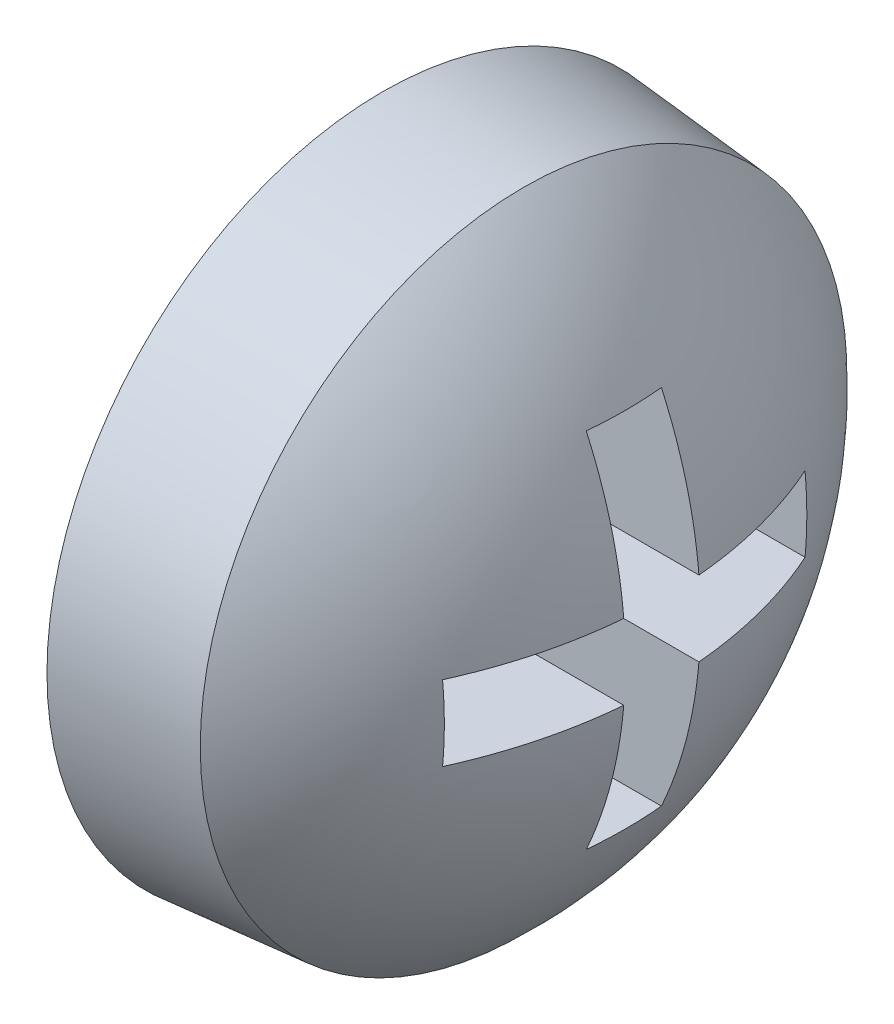
ISO-10303-21;
HEADER;
FILE_DESCRIPTION(('STEP AP214'),'2;1');
FILE_NAME('part.step','',(''),(''),'','','');
FILE_SCHEMA(('AUTOMOTIVE_DESIGN { 1 0 10303 214 1 1 1 1 }'));
ENDSEC;
DATA;
#1=APPLICATION_CONTEXT('core data for automotive mechanical design processes');
#2=APPLICATION_PROTOCOL_DEFINITION('international standard','automotive_design',2000,#1);
#3=PRODUCT_CONTEXT('',#1,'mechanical');
#4=PRODUCT('Part','Part','',(#3));
#5=PRODUCT_RELATED_PRODUCT_CATEGORY('part','',(#4));
#6=PRODUCT_DEFINITION_FORMATION('','',#4);
#7=PRODUCT_DEFINITION_CONTEXT('part definition',#1,'design');
#8=PRODUCT_DEFINITION('design','',#6,#7);
#9=PRODUCT_DEFINITION_SHAPE('','',#8);
#10=(LENGTH_UNIT() NAMED_UNIT(*) SI_UNIT(.MILLI.,.METRE.));
#11=(NAMED_UNIT(*) PLANE_ANGLE_UNIT() SI_UNIT($,.RADIAN.));
#12=(NAMED_UNIT(*) SI_UNIT($,.STERADIAN.) SOLID_ANGLE_UNIT());
#13=UNCERTAINTY_MEASURE_WITH_UNIT(LENGTH_MEASURE(1.E-05),#10,'distance_accuracy_value','');
#14=(GEOMETRIC_REPRESENTATION_CONTEXT(3) GLOBAL_UNCERTAINTY_ASSIGNED_CONTEXT((#13)) GLOBAL_UNIT_ASSIGNED_CONTEXT((#10,
#11,#12)) REPRESENTATION_CONTEXT('',''));
#15=CARTESIAN_POINT('',(0.,0.,0.));
#16=DIRECTION('',(0.,0.,1.));
#17=DIRECTION('',(1.,0.,0.));
#18=AXIS2_PLACEMENT_3D('',#15,#16,#17);
#19=CARTESIAN_POINT('',(0.549999999999995,0.,0.));
#20=DIRECTION('',(1.,0.,0.));
#21=DIRECTION('',(0.,0.,-1.));
#22=AXIS2_PLACEMENT_3D('',#19,#20,#21);
#23=PLANE('',#22);
#24=DIRECTION('',(0.,0.,1.));
#25=VECTOR('',#24,1.);
#26=CARTESIAN_POINT('',(0.549999999999995,-1.35,0.));
#27=LINE('',#26,#25);
#28=CARTESIAN_POINT('',(0.549999999999995,-1.35,-0.280000000000002));
#29=VERTEX_POINT('',#28);
#30=CARTESIAN_POINT('',(0.549999999999995,-1.35,0.280000000000001));
#31=VERTEX_POINT('',#30);
#32=EDGE_CURVE('E160',#29,#31,#27,.T.);
#33=ORIENTED_EDGE('',*,*,#32,.F.);
#34=DIRECTION('',(0.,1.,0.));
#35=VECTOR('',#34,1.);
#36=CARTESIAN_POINT('',(0.549999999999995,0.,-0.280000000000002));
#37=LINE('',#36,#35);
#38=CARTESIAN_POINT('',(0.549999999999995,-0.279999999999999,-0.280000000000002));
#39=VERTEX_POINT('',#38);
#40=EDGE_CURVE('E165',#39,#29,#37,.F.);
#41=ORIENTED_EDGE('',*,*,#40,.F.);
#42=DIRECTION('',(0.,0.,1.));
#43=VECTOR('',#42,1.);
#44=CARTESIAN_POINT('',(0.549999999999995,-0.279999999999999,0.));
#45=LINE('',#44,#43);
#46=CARTESIAN_POINT('',(0.549999999999995,-0.279999999999999,-1.35));
#47=VERTEX_POINT('',#46);
#48=EDGE_CURVE('E170',#47,#39,#45,.T.);
#49=ORIENTED_EDGE('',*,*,#48,.F.);
#50=DIRECTION('',(0.,1.,0.));
#51=VECTOR('',#50,1.);
#52=CARTESIAN_POINT('',(0.549999999999995,0.,-1.35));
#53=LINE('',#52,#51);
#54=CARTESIAN_POINT('',(0.549999999999995,0.280000000000002,-1.35));
#55=VERTEX_POINT('',#54);
#56=EDGE_CURVE('E175',#55,#47,#53,.F.);
#57=ORIENTED_EDGE('',*,*,#56,.F.);
#58=DIRECTION('',(0.,0.,-1.));
#59=VECTOR('',#58,1.);
#60=CARTESIAN_POINT('',(0.549999999999995,0.280000000000002,0.));
#61=LINE('',#60,#59);
#62=CARTESIAN_POINT('',(0.549999999999995,0.280000000000002,-0.280000000000002));
#63=VERTEX_POINT('',#62);
#64=EDGE_CURVE('E180',#63,#55,#61,.T.);
#65=ORIENTED_EDGE('',*,*,#64,.F.);
#66=DIRECTION('',(0.,1.,0.));
#67=VECTOR('',#66,1.);
#68=CARTESIAN_POINT('',(0.549999999999995,0.,-0.280000000000002));
#69=LINE('',#68,#67);
#70=CARTESIAN_POINT('',(0.549999999999995,1.35,-0.280000000000002));
#71=VERTEX_POINT('',#70);
#72=EDGE_CURVE('E185',#71,#63,#69,.F.);
#73=ORIENTED_EDGE('',*,*,#72,.F.);
#74=DIRECTION('',(0.,0.,1.));
#75=VECTOR('',#74,1.);
#76=CARTESIAN_POINT('',(0.549999999999995,1.35,0.));
#77=LINE('',#76,#75);
#78=CARTESIAN_POINT('',(0.549999999999995,1.35,0.280000000000001));
#79=VERTEX_POINT('',#78);
#80=EDGE_CURVE('E131',#71,#79,#77,.T.);
#81=ORIENTED_EDGE('',*,*,#80,.T.);
#82=DIRECTION('',(0.,1.,0.));
#83=VECTOR('',#82,1.);
#84=CARTESIAN_POINT('',(0.549999999999995,0.,0.279999999999999));
#85=LINE('',#84,#83);
#86=CARTESIAN_POINT('',(0.549999999999995,0.280000000000002,0.280000000000001));
#87=VERTEX_POINT('',#86);
#88=EDGE_CURVE('E128',#87,#79,#85,.T.);
#89=ORIENTED_EDGE('',*,*,#88,.F.);
#90=DIRECTION('',(0.,0.,-1.));
#91=VECTOR('',#90,1.);
#92=CARTESIAN_POINT('',(0.549999999999995,0.280000000000002,0.));
#93=LINE('',#92,#91);
#94=CARTESIAN_POINT('',(0.549999999999995,0.280000000000002,1.35));
#95=VERTEX_POINT('',#94);
#96=EDGE_CURVE('E122',#95,#87,#93,.T.);
#97=ORIENTED_EDGE('',*,*,#96,.F.);
#98=DIRECTION('',(0.,1.,0.));
#99=VECTOR('',#98,1.);
#100=CARTESIAN_POINT('',(0.549999999999995,0.,1.35));
#101=LINE('',#100,#99);
#102=CARTESIAN_POINT('',(0.549999999999995,-0.279999999999999,1.35));
#103=VERTEX_POINT('',#102);
#104=EDGE_CURVE('E92',#95,#103,#101,.F.);
#105=ORIENTED_EDGE('',*,*,#104,.T.);
#106=DIRECTION('',(0.,0.,1.));
#107=VECTOR('',#106,1.);
#108=CARTESIAN_POINT('',(0.549999999999995,-0.279999999999999,0.));
#109=LINE('',#108,#107);
#110=CARTESIAN_POINT('',(0.549999999999995,-0.279999999999999,0.280000000000001));
#111=VERTEX_POINT('',#110);
#112=EDGE_CURVE('E145',#111,#103,#109,.T.);
#113=ORIENTED_EDGE('',*,*,#112,.F.);
#114=DIRECTION('',(0.,1.,0.));
#115=VECTOR('',#114,1.);
#116=CARTESIAN_POINT('',(0.549999999999995,0.,0.279999999999999));
#117=LINE('',#116,#115);
#118=EDGE_CURVE('E155',#31,#111,#117,.T.);
#119=ORIENTED_EDGE('',*,*,#118,.F.);
#120=EDGE_LOOP('',(#33,#41,#49,#57,#65,#73,#81,#89,#97,#105,#113,#119));
#121=FACE_BOUND('',#120,.T.);
#122=ADVANCED_FACE('F17',(#121),#23,.T.);
#123=CARTESIAN_POINT('',(1.32499999999999,0.280000000000002,0.));
#124=DIRECTION('',(0.,-1.,0.));
#125=DIRECTION('',(0.,0.,-1.));
#126=AXIS2_PLACEMENT_3D('',#123,#124,#125);
#127=PLANE('',#126);
#128=DIRECTION('',(1.,0.,0.));
#129=VECTOR('',#128,1.);
#130=CARTESIAN_POINT('',(1.32499999999999,0.280000000000002,1.35));
#131=LINE('',#130,#129);
#132=CARTESIAN_POINT('',(1.79681603311908,0.280000000000002,1.35));
#133=VERTEX_POINT('',#132);
#134=EDGE_CURVE('E125',#133,#95,#131,.F.);
#135=ORIENTED_EDGE('',*,*,#134,.T.);
#136=ORIENTED_EDGE('',*,*,#96,.T.);
#137=DIRECTION('',(-1.,0.,0.));
#138=VECTOR('',#137,1.);
#139=CARTESIAN_POINT('',(1.32499999999999,0.280000000000002,0.279999999999999));
#140=LINE('',#139,#138);
#141=CARTESIAN_POINT('',(2.07605753086498,0.279999999999999,0.279999999999997));
#142=VERTEX_POINT('',#141);
#143=EDGE_CURVE('E77',#142,#87,#140,.T.);
#144=ORIENTED_EDGE('',*,*,#143,.F.);
#145=CARTESIAN_POINT('',(1.79681603311908,0.280000000000002,1.35));
#146=CARTESIAN_POINT('',(1.81602408056137,0.280000000000002,1.307554580257));
#147=CARTESIAN_POINT('',(1.83432508142264,0.280000000000002,1.26469878554267));
#148=CARTESIAN_POINT('',(1.86898914421727,0.280000000000002,1.17847728027552));
#149=CARTESIAN_POINT('',(1.88536206864593,0.280000000000002,1.13511553461517));
#150=CARTESIAN_POINT('',(1.91619749437211,0.280000000000002,1.04789225253094));
#151=CARTESIAN_POINT('',(1.93066661088959,0.280000000000002,1.00403305466245));
#152=CARTESIAN_POINT('',(1.95771277194949,0.280000000000002,0.915821473663348));
#153=CARTESIAN_POINT('',(1.97029317484131,0.280000000000002,0.871470120193011));
#154=CARTESIAN_POINT('',(1.9935704971157,0.280000000000002,0.782275874227943));
#155=CARTESIAN_POINT('',(2.00426741649827,0.280000000000002,0.737432981733211));
#156=CARTESIAN_POINT('',(2.02377634055015,0.280000000000002,0.647254382649075));
#157=CARTESIAN_POINT('',(2.03258491199652,0.280000000000002,0.601917933300477));
#158=CARTESIAN_POINT('',(2.04830486371433,0.280000000000003,0.510749915140327));
#159=CARTESIAN_POINT('',(2.05520932962495,0.280000000000003,0.464917154023976));
#160=CARTESIAN_POINT('',(2.06709937153223,0.280000000000002,0.37275223595096));
#161=CARTESIAN_POINT('',(2.07207440527889,0.280000000000001,0.326418718791774));
#162=CARTESIAN_POINT('',(2.07605753086497,0.279999999999999,0.279999999999996));
#163=B_SPLINE_CURVE_WITH_KNOTS('',3,(#145,#146,#147,#148,#149,#150,#151,#152,#153,#154,#155,
#156,#157,#158,#159,#160,#161,#162),.UNSPECIFIED.,.F.,.F.,(4,2,2,2,2,2,2,2,4),(0.,
0.139757136239739,0.278765100161038,0.417276520373942,0.555538657686308,0.693800794998674,
0.832312215211578,0.971320179132877,1.11107731537262),.UNSPECIFIED.);
#164=EDGE_CURVE('E20',#133,#142,#163,.T.);
#165=ORIENTED_EDGE('',*,*,#164,.F.);
#166=EDGE_LOOP('',(#135,#136,#144,#165));
#167=FACE_BOUND('',#166,.T.);
#168=ADVANCED_FACE('F124',(#167),#127,.T.);
#169=CARTESIAN_POINT('',(1.32499999999999,0.,0.279999999999999));
#170=DIRECTION('',(0.,0.,-1.));
#171=DIRECTION('',(-1.,0.,0.));
#172=AXIS2_PLACEMENT_3D('',#169,#170,#171);
#173=PLANE('',#172);
#174=ORIENTED_EDGE('',*,*,#88,.T.);
#175=DIRECTION('',(1.,0.,0.));
#176=VECTOR('',#175,1.);
#177=CARTESIAN_POINT('',(1.32499999999999,1.35,0.279999999999999));
#178=LINE('',#177,#176);
#179=CARTESIAN_POINT('',(1.79681603311908,1.35,0.279999999999999));
#180=VERTEX_POINT('',#179);
#181=EDGE_CURVE('E191',#79,#180,#178,.T.);
#182=ORIENTED_EDGE('',*,*,#181,.T.);
#183=CARTESIAN_POINT('',(2.07605753086497,0.279999999999999,0.279999999999996));
#184=CARTESIAN_POINT('',(2.06661079201182,0.390354074953385,0.279999999999998));
#185=CARTESIAN_POINT('',(2.05151697522497,0.500241063028344,0.279999999999999));
#186=CARTESIAN_POINT('',(2.01046909367367,0.717000858189269,0.279999999999999));
#187=CARTESIAN_POINT('',(1.98460832939249,0.823891335937797,0.279999999999999));
#188=CARTESIAN_POINT('',(1.93225828077782,1.00080541366203,0.279999999999999));
#189=CARTESIAN_POINT('',(1.90861656844528,1.07168394428635,0.279999999999999));
#190=CARTESIAN_POINT('',(1.85639490068904,1.21206786247378,0.279999999999999));
#191=CARTESIAN_POINT('',(1.82778700479986,1.28156285719201,0.28));
#192=CARTESIAN_POINT('',(1.79681603311908,1.34999999999999,0.280000000000002));
#193=B_SPLINE_CURVE_WITH_KNOTS('',3,(#183,#184,#185,#186,#187,#188,#189,#190,#191,#192),
.UNSPECIFIED.,.F.,.F.,(4,2,2,2,4),(0.,0.332166147649365,0.661511935360257,0.88549960279256,
1.11079091170104),.UNSPECIFIED.);
#194=EDGE_CURVE('E137',#142,#180,#193,.T.);
#195=ORIENTED_EDGE('',*,*,#194,.F.);
#196=ORIENTED_EDGE('',*,*,#143,.T.);
#197=EDGE_LOOP('',(#174,#182,#195,#196));
#198=FACE_BOUND('',#197,.T.);
#199=ADVANCED_FACE('F135',(#198),#173,.T.);
#200=CARTESIAN_POINT('',(1.32499999999999,1.35,0.));
#201=DIRECTION('',(0.,1.,0.));
#202=DIRECTION('',(0.,0.,1.));
#203=AXIS2_PLACEMENT_3D('',#200,#201,#202);
#204=PLANE('',#203);
#205=ORIENTED_EDGE('',*,*,#181,.F.);
#206=ORIENTED_EDGE('',*,*,#80,.F.);
#207=DIRECTION('',(1.,0.,0.));
#208=VECTOR('',#207,1.);
#209=CARTESIAN_POINT('',(1.32499999999999,1.35,-0.280000000000002));
#210=LINE('',#209,#208);
#211=CARTESIAN_POINT('',(1.79681603311908,1.35,-0.280000000000002));
#212=VERTEX_POINT('',#211);
#213=EDGE_CURVE('E187',#212,#71,#210,.F.);
#214=ORIENTED_EDGE('',*,*,#213,.F.);
#215=CARTESIAN_POINT('',(1.79681603311908,1.35,0.279999999999999));
#216=CARTESIAN_POINT('',(1.80555669105246,1.35,0.186666666666665));
#217=CARTESIAN_POINT('',(1.80992702001915,1.35,0.0933333333333319));
#218=CARTESIAN_POINT('',(1.80992702001915,1.35,-0.0933333333333353));
#219=CARTESIAN_POINT('',(1.80555669105246,1.35,-0.186666666666669));
#220=CARTESIAN_POINT('',(1.79681603311908,1.35,-0.280000000000002));
#221=B_SPLINE_CURVE_WITH_KNOTS('',3,(#215,#216,#217,#218,#219,#220),.UNSPECIFIED.,.F.,.F.,(4,2,
4),(0.,0.280306792599634,0.560613585199268),.UNSPECIFIED.);
#222=EDGE_CURVE('E265',#180,#212,#221,.T.);
#223=ORIENTED_EDGE('',*,*,#222,.F.);
#224=EDGE_LOOP('',(#205,#206,#214,#223));
#225=FACE_BOUND('',#224,.T.);
#226=ADVANCED_FACE('F266',(#225),#204,.F.);
#227=CARTESIAN_POINT('',(1.32499999999999,0.,-0.280000000000002));
#228=DIRECTION('',(0.,0.,1.));
#229=DIRECTION('',(1.,0.,0.));
#230=AXIS2_PLACEMENT_3D('',#227,#228,#229);
#231=PLANE('',#230);
#232=ORIENTED_EDGE('',*,*,#72,.T.);
#233=DIRECTION('',(1.,0.,0.));
#234=VECTOR('',#233,1.);
#235=CARTESIAN_POINT('',(1.32499999999999,0.280000000000002,-0.280000000000002));
#236=LINE('',#235,#234);
#237=CARTESIAN_POINT('',(2.07605753086498,0.280000000000002,-0.280000000000002));
#238=VERTEX_POINT('',#237);
#239=EDGE_CURVE('E182',#238,#63,#236,.F.);
#240=ORIENTED_EDGE('',*,*,#239,.F.);
#241=CARTESIAN_POINT('',(1.79681603311908,1.35,-0.280000000000002));
#242=CARTESIAN_POINT('',(1.81602408056137,1.307554580257,-0.280000000000002));
#243=CARTESIAN_POINT('',(1.83432508142264,1.26469878554267,-0.280000000000002));
#244=CARTESIAN_POINT('',(1.86898914421727,1.17847728027552,-0.280000000000002));
#245=CARTESIAN_POINT('',(1.88536206864593,1.13511553461517,-0.280000000000002));
#246=CARTESIAN_POINT('',(1.91619749437211,1.04789225253095,-0.280000000000002));
#247=CARTESIAN_POINT('',(1.93066661088959,1.00403305466245,-0.280000000000002));
#248=CARTESIAN_POINT('',(1.95771277194949,0.915821473663351,-0.280000000000002));
#249=CARTESIAN_POINT('',(1.97029317484131,0.871470120193015,-0.280000000000002));
#250=CARTESIAN_POINT('',(1.9935704971157,0.782275874227946,-0.280000000000002));
#251=CARTESIAN_POINT('',(2.00426741649827,0.737432981733214,-0.280000000000002));
#252=CARTESIAN_POINT('',(2.02377634055015,0.647254382649079,-0.280000000000002));
#253=CARTESIAN_POINT('',(2.03258491199652,0.60191793330048,-0.280000000000002));
#254=CARTESIAN_POINT('',(2.04830486371433,0.51074991514033,-0.280000000000003));
#255=CARTESIAN_POINT('',(2.05520932962495,0.46491715402398,-0.280000000000003));
#256=CARTESIAN_POINT('',(2.06709937153223,0.372752235950963,-0.280000000000002));
#257=CARTESIAN_POINT('',(2.07207440527889,0.326418718791777,-0.280000000000002));
#258=CARTESIAN_POINT('',(2.07605753086497,0.279999999999999,-0.280000000000001));
#259=B_SPLINE_CURVE_WITH_KNOTS('',3,(#241,#242,#243,#244,#245,#246,#247,#248,#249,#250,#251,
#252,#253,#254,#255,#256,#257,#258),.UNSPECIFIED.,.F.,.F.,(4,2,2,2,2,2,2,2,4),(0.,
0.139757136239739,0.278765100161038,0.417276520373942,0.555538657686308,0.693800794998673,
0.832312215211578,0.971320179132876,1.11107731537262),.UNSPECIFIED.);
#260=EDGE_CURVE('E269',#212,#238,#259,.T.);
#261=ORIENTED_EDGE('',*,*,#260,.F.);
#262=ORIENTED_EDGE('',*,*,#213,.T.);
#263=EDGE_LOOP('',(#232,#240,#261,#262));
#264=FACE_BOUND('',#263,.T.);
#265=ADVANCED_FACE('F360',(#264),#231,.T.);
#266=CARTESIAN_POINT('',(1.32499999999999,0.280000000000002,0.));
#267=DIRECTION('',(0.,-1.,0.));
#268=DIRECTION('',(0.,0.,-1.));
#269=AXIS2_PLACEMENT_3D('',#266,#267,#268);
#270=PLANE('',#269);
#271=DIRECTION('',(1.,0.,0.));
#272=VECTOR('',#271,1.);
#273=CARTESIAN_POINT('',(1.32499999999999,0.280000000000002,-1.35));
#274=LINE('',#273,#272);
#275=CARTESIAN_POINT('',(1.79681603311908,0.279999999999999,-1.35));
#276=VERTEX_POINT('',#275);
#277=EDGE_CURVE('E177',#276,#55,#274,.F.);
#278=ORIENTED_EDGE('',*,*,#277,.F.);
#279=CARTESIAN_POINT('',(2.07605753086497,0.280000000000002,-0.280000000000002));
#280=CARTESIAN_POINT('',(2.06661079201183,0.280000000000002,-0.390354074953392));
#281=CARTESIAN_POINT('',(2.05151697522498,0.280000000000002,-0.50024106302835));
#282=CARTESIAN_POINT('',(2.01046909367366,0.280000000000003,-0.717000858189273));
#283=CARTESIAN_POINT('',(1.98460832939248,0.280000000000003,-0.8238913359378));
#284=CARTESIAN_POINT('',(1.93225828077781,0.280000000000002,-1.00080541366204));
#285=CARTESIAN_POINT('',(1.90861656844527,0.280000000000002,-1.07168394428635));
#286=CARTESIAN_POINT('',(1.85639490068905,0.280000000000003,-1.21206786247379));
#287=CARTESIAN_POINT('',(1.82778700479986,0.280000000000004,-1.28156285719202));
#288=CARTESIAN_POINT('',(1.79681603311908,0.280000000000006,-1.34999999999998));
#289=B_SPLINE_CURVE_WITH_KNOTS('',3,(#279,#280,#281,#282,#283,#284,#285,#286,#287,#288),
.UNSPECIFIED.,.F.,.F.,(4,2,2,2,4),(0.,0.332166147649366,0.661511935360262,0.885499602792559,
1.11079091170103),.UNSPECIFIED.);
#290=EDGE_CURVE('E464',#238,#276,#289,.T.);
#291=ORIENTED_EDGE('',*,*,#290,.F.);
#292=ORIENTED_EDGE('',*,*,#239,.T.);
#293=ORIENTED_EDGE('',*,*,#64,.T.);
#294=EDGE_LOOP('',(#278,#291,#292,#293));
#295=FACE_BOUND('',#294,.T.);
#296=ADVANCED_FACE('F353',(#295),#270,.T.);
#297=CARTESIAN_POINT('',(1.32499999999999,0.,-1.35));
#298=DIRECTION('',(0.,0.,1.));
#299=DIRECTION('',(1.,0.,0.));
#300=AXIS2_PLACEMENT_3D('',#297,#298,#299);
#301=PLANE('',#300);
#302=DIRECTION('',(1.,0.,0.));
#303=VECTOR('',#302,1.);
#304=CARTESIAN_POINT('',(1.32499999999999,-0.279999999999999,-1.35));
#305=LINE('',#304,#303);
#306=CARTESIAN_POINT('',(1.79681603311908,-0.279999999999999,-1.35));
#307=VERTEX_POINT('',#306);
#308=EDGE_CURVE('E172',#307,#47,#305,.F.);
#309=ORIENTED_EDGE('',*,*,#308,.F.);
#310=CARTESIAN_POINT('',(1.79681603311908,0.279999999999999,-1.35));
#311=CARTESIAN_POINT('',(1.80555669105201,0.186666666666666,-1.35));
#312=CARTESIAN_POINT('',(1.80992702001848,0.093333333333333,-1.35));
#313=CARTESIAN_POINT('',(1.80992702001848,-0.093333333333333,-1.35));
#314=CARTESIAN_POINT('',(1.80555669105201,-0.186666666666666,-1.35));
#315=CARTESIAN_POINT('',(1.79681603311908,-0.279999999999999,-1.35));
#316=B_SPLINE_CURVE_WITH_KNOTS('',3,(#310,#311,#312,#313,#314,#315),.UNSPECIFIED.,.F.,.F.,(4,2,
4),(0.,0.280306792599601,0.560613585199201),.UNSPECIFIED.);
#317=EDGE_CURVE('E471',#276,#307,#316,.T.);
#318=ORIENTED_EDGE('',*,*,#317,.F.);
#319=ORIENTED_EDGE('',*,*,#277,.T.);
#320=ORIENTED_EDGE('',*,*,#56,.T.);
#321=EDGE_LOOP('',(#309,#318,#319,#320));
#322=FACE_BOUND('',#321,.T.);
#323=ADVANCED_FACE('F346',(#322),#301,.T.);
#324=CARTESIAN_POINT('',(1.32499999999999,-0.279999999999999,0.));
#325=DIRECTION('',(0.,1.,0.));
#326=DIRECTION('',(0.,0.,1.));
#327=AXIS2_PLACEMENT_3D('',#324,#325,#326);
#328=PLANE('',#327);
#329=ORIENTED_EDGE('',*,*,#308,.T.);
#330=ORIENTED_EDGE('',*,*,#48,.T.);
#331=DIRECTION('',(1.,0.,0.));
#332=VECTOR('',#331,1.);
#333=CARTESIAN_POINT('',(1.32499999999999,-0.279999999999999,-0.280000000000002));
#334=LINE('',#333,#332);
#335=CARTESIAN_POINT('',(2.07605753086498,-0.279999999999999,-0.280000000000002));
#336=VERTEX_POINT('',#335);
#337=EDGE_CURVE('E167',#336,#39,#334,.F.);
#338=ORIENTED_EDGE('',*,*,#337,.F.);
#339=CARTESIAN_POINT('',(1.79681603311908,-0.279999999999999,-1.35));
#340=CARTESIAN_POINT('',(1.81602408056137,-0.279999999999999,-1.307554580257));
#341=CARTESIAN_POINT('',(1.83432508142264,-0.279999999999999,-1.26469878554267));
#342=CARTESIAN_POINT('',(1.86898914421727,-0.279999999999999,-1.17847728027552));
#343=CARTESIAN_POINT('',(1.88536206864593,-0.279999999999999,-1.13511553461517));
#344=CARTESIAN_POINT('',(1.91619749437211,-0.279999999999999,-1.04789225253094));
#345=CARTESIAN_POINT('',(1.93066661088959,-0.279999999999999,-1.00403305466245));
#346=CARTESIAN_POINT('',(1.95771277194949,-0.279999999999999,-0.915821473663351));
#347=CARTESIAN_POINT('',(1.97029317484131,-0.279999999999999,-0.871470120193014));
#348=CARTESIAN_POINT('',(1.9935704971157,-0.279999999999999,-0.782275874227947));
#349=CARTESIAN_POINT('',(2.00426741649827,-0.279999999999999,-0.737432981733215));
#350=CARTESIAN_POINT('',(2.02377634055015,-0.279999999999999,-0.64725438264908));
#351=CARTESIAN_POINT('',(2.03258491199652,-0.279999999999999,-0.601917933300482));
#352=CARTESIAN_POINT('',(2.04830486371433,-0.279999999999999,-0.510749915140332));
#353=CARTESIAN_POINT('',(2.05520932962495,-0.279999999999999,-0.464917154023982));
#354=CARTESIAN_POINT('',(2.06709937153223,-0.279999999999999,-0.372752235950966));
#355=CARTESIAN_POINT('',(2.07207440527889,-0.279999999999999,-0.32641871879178));
#356=CARTESIAN_POINT('',(2.07605753086497,-0.279999999999999,-0.280000000000002));
#357=B_SPLINE_CURVE_WITH_KNOTS('',3,(#339,#340,#341,#342,#343,#344,#345,#346,#347,#348,#349,
#350,#351,#352,#353,#354,#355,#356),.UNSPECIFIED.,.F.,.F.,(4,2,2,2,2,2,2,2,4),(0.,
0.139757136239738,0.278765100161036,0.417276520373939,0.555538657686305,0.693800794998669,
0.832312215211573,0.971320179132871,1.11107731537261),.UNSPECIFIED.);
#358=EDGE_CURVE('E478',#307,#336,#357,.T.);
#359=ORIENTED_EDGE('',*,*,#358,.F.);
#360=EDGE_LOOP('',(#329,#330,#338,#359));
#361=FACE_BOUND('',#360,.T.);
#362=ADVANCED_FACE('F339',(#361),#328,.T.);
#363=CARTESIAN_POINT('',(1.32499999999999,0.,-0.280000000000002));
#364=DIRECTION('',(0.,0.,1.));
#365=DIRECTION('',(1.,0.,0.));
#366=AXIS2_PLACEMENT_3D('',#363,#364,#365);
#367=PLANE('',#366);
#368=ORIENTED_EDGE('',*,*,#40,.T.);
#369=DIRECTION('',(1.,0.,0.));
#370=VECTOR('',#369,1.);
#371=CARTESIAN_POINT('',(1.32499999999999,-1.35,-0.280000000000002));
#372=LINE('',#371,#370);
#373=CARTESIAN_POINT('',(1.79681603311908,-1.35,-0.280000000000002));
#374=VERTEX_POINT('',#373);
#375=EDGE_CURVE('E162',#374,#29,#372,.F.);
#376=ORIENTED_EDGE('',*,*,#375,.F.);
#377=CARTESIAN_POINT('',(2.07605753086497,-0.279999999999999,-0.280000000000002));
#378=CARTESIAN_POINT('',(2.06661079201183,-0.390354074953389,-0.280000000000002));
#379=CARTESIAN_POINT('',(2.05151697522498,-0.500241063028347,-0.280000000000002));
#380=CARTESIAN_POINT('',(2.01046909367366,-0.717000858189271,-0.280000000000003));
#381=CARTESIAN_POINT('',(1.98460832939248,-0.823891335937798,-0.280000000000003));
#382=CARTESIAN_POINT('',(1.93225828077781,-1.00080541366203,-0.280000000000002));
#383=CARTESIAN_POINT('',(1.90861656844527,-1.07168394428635,-0.280000000000002));
#384=CARTESIAN_POINT('',(1.85639490068905,-1.21206786247379,-0.280000000000003));
#385=CARTESIAN_POINT('',(1.82778700479986,-1.28156285719202,-0.280000000000003));
#386=CARTESIAN_POINT('',(1.79681603311908,-1.34999999999999,-0.280000000000004));
#387=B_SPLINE_CURVE_WITH_KNOTS('',3,(#377,#378,#379,#380,#381,#382,#383,#384,#385,#386),
.UNSPECIFIED.,.F.,.F.,(4,2,2,2,4),(0.,0.332166147649367,0.661511935360264,0.885499602792562,
1.11079091170103),.UNSPECIFIED.);
#388=EDGE_CURVE('E488',#336,#374,#387,.T.);
#389=ORIENTED_EDGE('',*,*,#388,.F.);
#390=ORIENTED_EDGE('',*,*,#337,.T.);
#391=EDGE_LOOP('',(#368,#376,#389,#390));
#392=FACE_BOUND('',#391,.T.);
#393=ADVANCED_FACE('F332',(#392),#367,.T.);
#394=CARTESIAN_POINT('',(1.32499999999999,-1.35,0.));
#395=DIRECTION('',(0.,1.,0.));
#396=DIRECTION('',(0.,0.,1.));
#397=AXIS2_PLACEMENT_3D('',#394,#395,#396);
#398=PLANE('',#397);
#399=ORIENTED_EDGE('',*,*,#32,.T.);
#400=DIRECTION('',(-1.,0.,0.));
#401=VECTOR('',#400,1.);
#402=CARTESIAN_POINT('',(1.32499999999999,-1.35,0.279999999999999));
#403=LINE('',#402,#401);
#404=CARTESIAN_POINT('',(1.79681603311908,-1.35,0.279999999999999));
#405=VERTEX_POINT('',#404);
#406=EDGE_CURVE('E157',#405,#31,#403,.T.);
#407=ORIENTED_EDGE('',*,*,#406,.F.);
#408=CARTESIAN_POINT('',(1.79681603311908,-1.35,-0.280000000000002));
#409=CARTESIAN_POINT('',(1.80555669105246,-1.35,-0.186666666666669));
#410=CARTESIAN_POINT('',(1.80992702001915,-1.35,-0.0933333333333353));
#411=CARTESIAN_POINT('',(1.80992702001915,-1.35,0.0933333333333318));
#412=CARTESIAN_POINT('',(1.80555669105246,-1.35,0.186666666666665));
#413=CARTESIAN_POINT('',(1.79681603311908,-1.35,0.279999999999999));
#414=B_SPLINE_CURVE_WITH_KNOTS('',3,(#408,#409,#410,#411,#412,#413),.UNSPECIFIED.,.F.,.F.,(4,2,
4),(0.,0.280306792599634,0.560613585199268),.UNSPECIFIED.);
#415=EDGE_CURVE('E495',#374,#405,#414,.T.);
#416=ORIENTED_EDGE('',*,*,#415,.F.);
#417=ORIENTED_EDGE('',*,*,#375,.T.);
#418=EDGE_LOOP('',(#399,#407,#416,#417));
#419=FACE_BOUND('',#418,.T.);
#420=ADVANCED_FACE('F325',(#419),#398,.T.);
#421=CARTESIAN_POINT('',(1.32499999999999,0.,0.279999999999999));
#422=DIRECTION('',(0.,0.,-1.));
#423=DIRECTION('',(-1.,0.,0.));
#424=AXIS2_PLACEMENT_3D('',#421,#422,#423);
#425=PLANE('',#424);
#426=ORIENTED_EDGE('',*,*,#118,.T.);
#427=DIRECTION('',(1.,0.,0.));
#428=VECTOR('',#427,1.);
#429=CARTESIAN_POINT('',(1.32499999999999,-0.279999999999999,0.279999999999999));
#430=LINE('',#429,#428);
#431=CARTESIAN_POINT('',(2.07605753086498,-0.279999999999996,0.279999999999996));
#432=VERTEX_POINT('',#431);
#433=EDGE_CURVE('E147',#432,#111,#430,.F.);
#434=ORIENTED_EDGE('',*,*,#433,.F.);
#435=CARTESIAN_POINT('',(1.79681603311908,-1.35,0.279999999999999));
#436=CARTESIAN_POINT('',(1.81602408056137,-1.307554580257,0.279999999999999));
#437=CARTESIAN_POINT('',(1.83432508142264,-1.26469878554267,0.279999999999999));
#438=CARTESIAN_POINT('',(1.86898914421727,-1.17847728027552,0.279999999999999));
#439=CARTESIAN_POINT('',(1.88536206864593,-1.13511553461517,0.279999999999999));
#440=CARTESIAN_POINT('',(1.91619749437211,-1.04789225253094,0.279999999999999));
#441=CARTESIAN_POINT('',(1.93066661088959,-1.00403305466245,0.279999999999999));
#442=CARTESIAN_POINT('',(1.95771277194949,-0.915821473663351,0.279999999999999));
#443=CARTESIAN_POINT('',(1.97029317484131,-0.871470120193014,0.279999999999999));
#444=CARTESIAN_POINT('',(1.9935704971157,-0.782275874227947,0.279999999999999));
#445=CARTESIAN_POINT('',(2.00426741649827,-0.737432981733215,0.279999999999999));
#446=CARTESIAN_POINT('',(2.02377634055015,-0.64725438264908,0.279999999999999));
#447=CARTESIAN_POINT('',(2.03258491199652,-0.601917933300482,0.279999999999999));
#448=CARTESIAN_POINT('',(2.04830486371433,-0.510749915140332,0.279999999999999));
#449=CARTESIAN_POINT('',(2.05520932962495,-0.464917154023982,0.279999999999999));
#450=CARTESIAN_POINT('',(2.06709937153223,-0.372752235950966,0.279999999999999));
#451=CARTESIAN_POINT('',(2.07207440527889,-0.32641871879178,0.279999999999998));
#452=CARTESIAN_POINT('',(2.07605753086497,-0.280000000000002,0.279999999999997));
#453=B_SPLINE_CURVE_WITH_KNOTS('',3,(#435,#436,#437,#438,#439,#440,#441,#442,#443,#444,#445,
#446,#447,#448,#449,#450,#451,#452),.UNSPECIFIED.,.F.,.F.,(4,2,2,2,2,2,2,2,4),(0.,
0.139757136239738,0.278765100161036,0.417276520373939,0.555538657686305,0.693800794998669,
0.832312215211573,0.971320179132871,1.11107731537261),.UNSPECIFIED.);
#454=EDGE_CURVE('E501',#405,#432,#453,.T.);
#455=ORIENTED_EDGE('',*,*,#454,.F.);
#456=ORIENTED_EDGE('',*,*,#406,.T.);
#457=EDGE_LOOP('',(#426,#434,#455,#456));
#458=FACE_BOUND('',#457,.T.);
#459=ADVANCED_FACE('F320',(#458),#425,.T.);
#460=CARTESIAN_POINT('',(1.32499999999999,-0.279999999999999,0.));
#461=DIRECTION('',(0.,1.,0.));
#462=DIRECTION('',(0.,0.,1.));
#463=AXIS2_PLACEMENT_3D('',#460,#461,#462);
#464=PLANE('',#463);
#465=DIRECTION('',(1.,0.,0.));
#466=VECTOR('',#465,1.);
#467=CARTESIAN_POINT('',(1.32499999999999,-0.279999999999999,1.35));
#468=LINE('',#467,#466);
#469=CARTESIAN_POINT('',(1.79681603311908,-0.279999999999999,1.35));
#470=VERTEX_POINT('',#469);
#471=EDGE_CURVE('E40',#103,#470,#468,.T.);
#472=ORIENTED_EDGE('',*,*,#471,.T.);
#473=CARTESIAN_POINT('',(2.07605753086497,-0.279999999999992,0.279999999999994));
#474=CARTESIAN_POINT('',(2.06661079201182,-0.279999999999996,0.390354074953381));
#475=CARTESIAN_POINT('',(2.05151697522497,-0.279999999999998,0.50024106302834));
#476=CARTESIAN_POINT('',(2.01046909367367,-0.28,0.717000858189266));
#477=CARTESIAN_POINT('',(1.98460832939249,-0.279999999999999,0.823891335937795));
#478=CARTESIAN_POINT('',(1.93225828077782,-0.279999999999999,1.00080541366203));
#479=CARTESIAN_POINT('',(1.90861656844528,-0.279999999999999,1.07168394428635));
#480=CARTESIAN_POINT('',(1.85639490068905,-0.279999999999999,1.21206786247378));
#481=CARTESIAN_POINT('',(1.82778700479986,-0.28,1.28156285719201));
#482=CARTESIAN_POINT('',(1.7968160331191,-0.280000000000002,1.34999999999999));
#483=B_SPLINE_CURVE_WITH_KNOTS('',3,(#473,#474,#475,#476,#477,#478,#479,#480,#481,#482),
.UNSPECIFIED.,.F.,.F.,(4,2,2,2,4),(0.,0.332166147649366,0.661511935360261,0.885499602792561,
1.11079091170103),.UNSPECIFIED.);
#484=EDGE_CURVE('E202',#432,#470,#483,.T.);
#485=ORIENTED_EDGE('',*,*,#484,.F.);
#486=ORIENTED_EDGE('',*,*,#433,.T.);
#487=ORIENTED_EDGE('',*,*,#112,.T.);
#488=EDGE_LOOP('',(#472,#485,#486,#487));
#489=FACE_BOUND('',#488,.T.);
#490=ADVANCED_FACE('F314',(#489),#464,.T.);
#491=CARTESIAN_POINT('',(1.32499999999999,0.,1.35));
#492=DIRECTION('',(0.,0.,1.));
#493=DIRECTION('',(1.,0.,0.));
#494=AXIS2_PLACEMENT_3D('',#491,#492,#493);
#495=PLANE('',#494);
#496=ORIENTED_EDGE('',*,*,#471,.F.);
#497=ORIENTED_EDGE('',*,*,#104,.F.);
#498=ORIENTED_EDGE('',*,*,#134,.F.);
#499=CARTESIAN_POINT('',(1.79681603311908,-0.279999999999999,1.35));
#500=CARTESIAN_POINT('',(1.80555669105202,-0.186666666666666,1.35));
#501=CARTESIAN_POINT('',(1.80992702001849,-0.093333333333333,1.35));
#502=CARTESIAN_POINT('',(1.80992702001849,0.0933333333333341,1.35));
#503=CARTESIAN_POINT('',(1.80555669105202,0.186666666666668,1.35));
#504=CARTESIAN_POINT('',(1.79681603311908,0.280000000000002,1.35));
#505=B_SPLINE_CURVE_WITH_KNOTS('',3,(#499,#500,#501,#502,#503,#504),.UNSPECIFIED.,.F.,.F.,(4,2,
4),(0.,0.280306792599601,0.560613585199206),.UNSPECIFIED.);
#506=EDGE_CURVE('E84',#470,#133,#505,.T.);
#507=ORIENTED_EDGE('',*,*,#506,.F.);
#508=EDGE_LOOP('',(#496,#497,#498,#507));
#509=FACE_BOUND('',#508,.T.);
#510=ADVANCED_FACE('F209',(#509),#495,.F.);
#511=CARTESIAN_POINT('',(-1.18648730715461,0.,0.));
#512=DIRECTION('',(1.,0.,0.));
#513=DIRECTION('',(0.,1.,0.));
#514=AXIS2_PLACEMENT_3D('',#511,#512,#513);
#515=SPHERICAL_SURFACE('',#514,3.28648730715458);
#516=CARTESIAN_POINT('',(1.05000000002255,0.,0.));
#517=DIRECTION('',(-1.,0.,0.));
#518=DIRECTION('',(0.,0.,1.));
#519=AXIS2_PLACEMENT_3D('',#516,#517,#518);
#520=CIRCLE('',#519,2.40813690328375);
#521=CARTESIAN_POINT('',(1.05000000002255,0.,2.40813690328375));
#522=VERTEX_POINT('',#521);
#523=EDGE_CURVE('E31',#522,#522,#520,.T.);
#524=ORIENTED_EDGE('',*,*,#523,.F.);
#525=EDGE_LOOP('',(#524));
#526=FACE_BOUND('',#525,.T.);
#527=ORIENTED_EDGE('',*,*,#484,.T.);
#528=ORIENTED_EDGE('',*,*,#506,.T.);
#529=ORIENTED_EDGE('',*,*,#164,.T.);
#530=ORIENTED_EDGE('',*,*,#194,.T.);
#531=ORIENTED_EDGE('',*,*,#222,.T.);
#532=ORIENTED_EDGE('',*,*,#260,.T.);
#533=ORIENTED_EDGE('',*,*,#290,.T.);
#534=ORIENTED_EDGE('',*,*,#317,.T.);
#535=ORIENTED_EDGE('',*,*,#358,.T.);
#536=ORIENTED_EDGE('',*,*,#388,.T.);
#537=ORIENTED_EDGE('',*,*,#415,.T.);
#538=ORIENTED_EDGE('',*,*,#454,.T.);
#539=EDGE_LOOP('',(#527,#528,#529,#530,#531,#532,#533,#534,#535,#536,#537,#538));
#540=FACE_BOUND('',#539,.T.);
#541=ADVANCED_FACE('F211',(#526,#540),#515,.T.);
#542=CARTESIAN_POINT('',(1.90125692967058E-12,0.,0.));
#543=DIRECTION('',(-1.,0.,0.));
#544=DIRECTION('',(0.,0.,1.));
#545=AXIS2_PLACEMENT_3D('',#542,#543,#544);
#546=CONICAL_SURFACE('',#545,2.49999999999014,0.0872664625999355);
#547=CARTESIAN_POINT('',(1.90125692967058E-12,0.,0.));
#548=DIRECTION('',(-1.,0.,0.));
#549=DIRECTION('',(0.,0.,1.));
#550=AXIS2_PLACEMENT_3D('',#547,#548,#549);
#551=CIRCLE('',#550,2.49999999999014);
#552=CARTESIAN_POINT('',(1.90125692967058E-12,0.,2.49999999999014));
#553=VERTEX_POINT('',#552);
#554=EDGE_CURVE('E11',#553,#553,#551,.T.);
#555=ORIENTED_EDGE('',*,*,#554,.F.);
#556=EDGE_LOOP('',(#555));
#557=FACE_BOUND('',#556,.T.);
#558=ORIENTED_EDGE('',*,*,#523,.T.);
#559=EDGE_LOOP('',(#558));
#560=FACE_BOUND('',#559,.T.);
#561=ADVANCED_FACE('F216',(#557,#560),#546,.T.);
#562=CARTESIAN_POINT('',(0.,0.,1.25));
#563=DIRECTION('',(-1.,0.,0.));
#564=DIRECTION('',(0.,0.,1.));
#565=AXIS2_PLACEMENT_3D('',#562,#563,#564);
#566=PLANE('',#565);
#567=ORIENTED_EDGE('',*,*,#554,.T.);
#568=EDGE_LOOP('',(#567));
#569=FACE_BOUND('',#568,.T.);
#570=ADVANCED_FACE('F292',(#569),#566,.T.);
#571=CLOSED_SHELL('',(#122,#168,#199,#226,#265,#296,#323,#362,#393,#420,#459,#490,#510,#541,
#561,#570));
#572=MANIFOLD_SOLID_BREP('B1',#571);
#573=ADVANCED_BREP_SHAPE_REPRESENTATION('',(#18,#572),#14);
#574=SHAPE_DEFINITION_REPRESENTATION(#9,#573);
ENDSEC;
END-ISO-10303-21;
